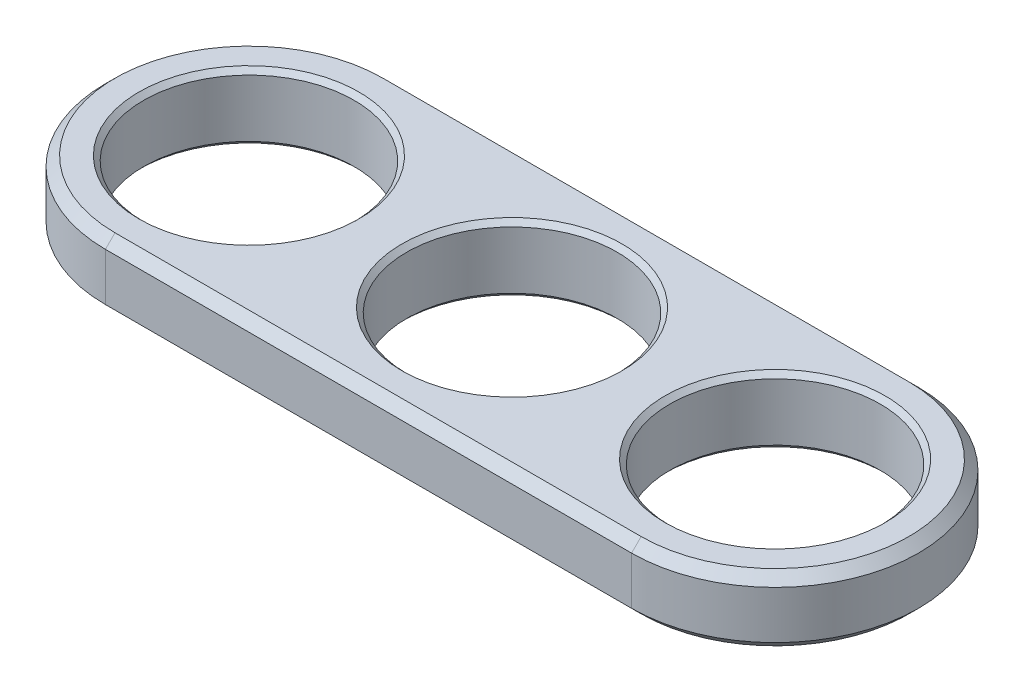
ISO-10303-21;
HEADER;
FILE_DESCRIPTION(('STEP AP214'),'2;1');
FILE_NAME('part.step','',(''),(''),'','','');
FILE_SCHEMA(('AUTOMOTIVE_DESIGN { 1 0 10303 214 1 1 1 1 }'));
ENDSEC;
DATA;
#1=APPLICATION_CONTEXT('core data for automotive mechanical design processes');
#2=APPLICATION_PROTOCOL_DEFINITION('international standard','automotive_design',2000,#1);
#3=PRODUCT_CONTEXT('',#1,'mechanical');
#4=PRODUCT('Part','Part','',(#3));
#5=PRODUCT_RELATED_PRODUCT_CATEGORY('part','',(#4));
#6=PRODUCT_DEFINITION_FORMATION('','',#4);
#7=PRODUCT_DEFINITION_CONTEXT('part definition',#1,'design');
#8=PRODUCT_DEFINITION('design','',#6,#7);
#9=PRODUCT_DEFINITION_SHAPE('','',#8);
#10=(LENGTH_UNIT() NAMED_UNIT(*) SI_UNIT(.MILLI.,.METRE.));
#11=(NAMED_UNIT(*) PLANE_ANGLE_UNIT() SI_UNIT($,.RADIAN.));
#12=(NAMED_UNIT(*) SI_UNIT($,.STERADIAN.) SOLID_ANGLE_UNIT());
#13=UNCERTAINTY_MEASURE_WITH_UNIT(LENGTH_MEASURE(1.E-05),#10,'distance_accuracy_value','');
#14=(GEOMETRIC_REPRESENTATION_CONTEXT(3) GLOBAL_UNCERTAINTY_ASSIGNED_CONTEXT((#13)) GLOBAL_UNIT_ASSIGNED_CONTEXT((#10,
#11,#12)) REPRESENTATION_CONTEXT('',''));
#15=CARTESIAN_POINT('',(0.,0.,0.));
#16=DIRECTION('',(0.,0.,1.));
#17=DIRECTION('',(1.,0.,0.));
#18=AXIS2_PLACEMENT_3D('',#15,#16,#17);
#19=CARTESIAN_POINT('',(0.,7.,0.));
#20=DIRECTION('',(0.,1.,0.));
#21=DIRECTION('',(0.,0.,1.));
#22=AXIS2_PLACEMENT_3D('',#19,#20,#21);
#23=PLANE('',#22);
#24=CARTESIAN_POINT('',(55.,7.,0.));
#25=DIRECTION('',(0.,1.,0.));
#26=DIRECTION('',(0.,0.,1.));
#27=AXIS2_PLACEMENT_3D('',#24,#25,#26);
#28=CIRCLE('',#27,14.);
#29=CARTESIAN_POINT('',(55.,7.,14.));
#30=VERTEX_POINT('',#29);
#31=CARTESIAN_POINT('',(55.,7.,-14.));
#32=VERTEX_POINT('',#31);
#33=EDGE_CURVE('E59',#30,#32,#28,.T.);
#34=ORIENTED_EDGE('',*,*,#33,.T.);
#35=DIRECTION('',(-1.,0.,0.));
#36=VECTOR('',#35,1.);
#37=CARTESIAN_POINT('',(0.,7.,-14.));
#38=LINE('',#37,#36);
#39=CARTESIAN_POINT('',(0.,7.,-14.));
#40=VERTEX_POINT('',#39);
#41=EDGE_CURVE('E11',#32,#40,#38,.T.);
#42=ORIENTED_EDGE('',*,*,#41,.T.);
#43=CARTESIAN_POINT('',(0.,7.,0.));
#44=DIRECTION('',(0.,1.,0.));
#45=DIRECTION('',(0.,0.,1.));
#46=AXIS2_PLACEMENT_3D('',#43,#44,#45);
#47=CIRCLE('',#46,14.);
#48=CARTESIAN_POINT('',(0.,7.,14.));
#49=VERTEX_POINT('',#48);
#50=EDGE_CURVE('E44',#40,#49,#47,.T.);
#51=ORIENTED_EDGE('',*,*,#50,.T.);
#52=DIRECTION('',(1.,0.,0.));
#53=VECTOR('',#52,1.);
#54=CARTESIAN_POINT('',(55.,7.,14.));
#55=LINE('',#54,#53);
#56=EDGE_CURVE('E188',#49,#30,#55,.T.);
#57=ORIENTED_EDGE('',*,*,#56,.T.);
#58=EDGE_LOOP('',(#34,#42,#51,#57));
#59=FACE_BOUND('',#58,.T.);
#60=CARTESIAN_POINT('',(55.,7.,0.));
#61=DIRECTION('',(0.,1.,0.));
#62=DIRECTION('',(0.,0.,1.));
#63=AXIS2_PLACEMENT_3D('',#60,#61,#62);
#64=CIRCLE('',#63,11.5);
#65=CARTESIAN_POINT('',(55.,7.,11.5));
#66=VERTEX_POINT('',#65);
#67=EDGE_CURVE('E227',#66,#66,#64,.F.);
#68=ORIENTED_EDGE('',*,*,#67,.T.);
#69=EDGE_LOOP('',(#68));
#70=FACE_BOUND('',#69,.T.);
#71=CARTESIAN_POINT('',(27.5,7.,0.));
#72=DIRECTION('',(0.,1.,0.));
#73=DIRECTION('',(0.,0.,1.));
#74=AXIS2_PLACEMENT_3D('',#71,#72,#73);
#75=CIRCLE('',#74,11.5);
#76=CARTESIAN_POINT('',(27.5,7.,11.5));
#77=VERTEX_POINT('',#76);
#78=EDGE_CURVE('E224',#77,#77,#75,.F.);
#79=ORIENTED_EDGE('',*,*,#78,.T.);
#80=EDGE_LOOP('',(#79));
#81=FACE_BOUND('',#80,.T.);
#82=CARTESIAN_POINT('',(0.,7.,0.));
#83=DIRECTION('',(0.,1.,0.));
#84=DIRECTION('',(0.,0.,1.));
#85=AXIS2_PLACEMENT_3D('',#82,#83,#84);
#86=CIRCLE('',#85,11.5);
#87=CARTESIAN_POINT('',(0.,7.,11.5));
#88=VERTEX_POINT('',#87);
#89=EDGE_CURVE('E221',#88,#88,#86,.F.);
#90=ORIENTED_EDGE('',*,*,#89,.T.);
#91=EDGE_LOOP('',(#90));
#92=FACE_BOUND('',#91,.T.);
#93=ADVANCED_FACE('F35',(#59,#70,#81,#92),#23,.T.);
#94=CARTESIAN_POINT('',(0.,0.,0.));
#95=DIRECTION('',(0.,1.,0.));
#96=DIRECTION('',(0.,0.,1.));
#97=AXIS2_PLACEMENT_3D('',#94,#95,#96);
#98=PLANE('',#97);
#99=CARTESIAN_POINT('',(0.,0.,0.));
#100=DIRECTION('',(0.,1.,0.));
#101=DIRECTION('',(0.,0.,1.));
#102=AXIS2_PLACEMENT_3D('',#99,#100,#101);
#103=CIRCLE('',#102,14.);
#104=CARTESIAN_POINT('',(0.,0.,14.));
#105=VERTEX_POINT('',#104);
#106=CARTESIAN_POINT('',(0.,0.,-14.));
#107=VERTEX_POINT('',#106);
#108=EDGE_CURVE('E175',#105,#107,#103,.F.);
#109=ORIENTED_EDGE('',*,*,#108,.T.);
#110=DIRECTION('',(1.,0.,0.));
#111=VECTOR('',#110,1.);
#112=CARTESIAN_POINT('',(0.,0.,-14.));
#113=LINE('',#112,#111);
#114=CARTESIAN_POINT('',(55.,0.,-14.));
#115=VERTEX_POINT('',#114);
#116=EDGE_CURVE('E115',#107,#115,#113,.T.);
#117=ORIENTED_EDGE('',*,*,#116,.T.);
#118=CARTESIAN_POINT('',(55.,0.,0.));
#119=DIRECTION('',(0.,1.,0.));
#120=DIRECTION('',(0.,0.,1.));
#121=AXIS2_PLACEMENT_3D('',#118,#119,#120);
#122=CIRCLE('',#121,14.);
#123=CARTESIAN_POINT('',(55.,0.,14.));
#124=VERTEX_POINT('',#123);
#125=EDGE_CURVE('E164',#115,#124,#122,.F.);
#126=ORIENTED_EDGE('',*,*,#125,.T.);
#127=DIRECTION('',(-1.,0.,0.));
#128=VECTOR('',#127,1.);
#129=CARTESIAN_POINT('',(0.,0.,14.));
#130=LINE('',#129,#128);
#131=EDGE_CURVE('E172',#124,#105,#130,.T.);
#132=ORIENTED_EDGE('',*,*,#131,.T.);
#133=EDGE_LOOP('',(#109,#117,#126,#132));
#134=FACE_BOUND('',#133,.T.);
#135=CARTESIAN_POINT('',(55.,0.,0.));
#136=DIRECTION('',(0.,1.,0.));
#137=DIRECTION('',(0.,0.,1.));
#138=AXIS2_PLACEMENT_3D('',#135,#136,#137);
#139=CIRCLE('',#138,11.5);
#140=CARTESIAN_POINT('',(55.,0.,11.5));
#141=VERTEX_POINT('',#140);
#142=EDGE_CURVE('E212',#141,#141,#139,.T.);
#143=ORIENTED_EDGE('',*,*,#142,.T.);
#144=EDGE_LOOP('',(#143));
#145=FACE_BOUND('',#144,.T.);
#146=CARTESIAN_POINT('',(27.5,0.,0.));
#147=DIRECTION('',(0.,1.,0.));
#148=DIRECTION('',(0.,0.,1.));
#149=AXIS2_PLACEMENT_3D('',#146,#147,#148);
#150=CIRCLE('',#149,11.5);
#151=CARTESIAN_POINT('',(27.5,0.,11.5));
#152=VERTEX_POINT('',#151);
#153=EDGE_CURVE('E209',#152,#152,#150,.T.);
#154=ORIENTED_EDGE('',*,*,#153,.T.);
#155=EDGE_LOOP('',(#154));
#156=FACE_BOUND('',#155,.T.);
#157=CARTESIAN_POINT('',(0.,0.,0.));
#158=DIRECTION('',(0.,1.,0.));
#159=DIRECTION('',(0.,0.,1.));
#160=AXIS2_PLACEMENT_3D('',#157,#158,#159);
#161=CIRCLE('',#160,11.5);
#162=CARTESIAN_POINT('',(0.,0.,11.5));
#163=VERTEX_POINT('',#162);
#164=EDGE_CURVE('E203',#163,#163,#161,.T.);
#165=ORIENTED_EDGE('',*,*,#164,.T.);
#166=EDGE_LOOP('',(#165));
#167=FACE_BOUND('',#166,.T.);
#168=ADVANCED_FACE('F253',(#134,#145,#156,#167),#98,.F.);
#169=CARTESIAN_POINT('',(0.,7.,0.));
#170=DIRECTION('',(0.,-1.,0.));
#171=DIRECTION('',(0.,0.,-1.));
#172=AXIS2_PLACEMENT_3D('',#169,#170,#171);
#173=CYLINDRICAL_SURFACE('',#172,15.);
#174=DIRECTION('',(0.,-1.,0.));
#175=VECTOR('',#174,1.);
#176=CARTESIAN_POINT('',(0.,7.,-15.));
#177=LINE('',#176,#175);
#178=CARTESIAN_POINT('',(0.,6.,-15.));
#179=VERTEX_POINT('',#178);
#180=CARTESIAN_POINT('',(0.,0.999999999999987,-15.));
#181=VERTEX_POINT('',#180);
#182=EDGE_CURVE('E108',#179,#181,#177,.T.);
#183=ORIENTED_EDGE('',*,*,#182,.T.);
#184=CARTESIAN_POINT('',(0.,0.999999999999987,0.));
#185=DIRECTION('',(0.,1.,0.));
#186=DIRECTION('',(0.,0.,1.));
#187=AXIS2_PLACEMENT_3D('',#184,#185,#186);
#188=CIRCLE('',#187,15.);
#189=CARTESIAN_POINT('',(0.,0.999999999999987,15.));
#190=VERTEX_POINT('',#189);
#191=EDGE_CURVE('E114',#181,#190,#188,.T.);
#192=ORIENTED_EDGE('',*,*,#191,.T.);
#193=DIRECTION('',(0.,-1.,0.));
#194=VECTOR('',#193,1.);
#195=CARTESIAN_POINT('',(0.,7.,15.));
#196=LINE('',#195,#194);
#197=CARTESIAN_POINT('',(0.,6.,15.));
#198=VERTEX_POINT('',#197);
#199=EDGE_CURVE('E110',#198,#190,#196,.T.);
#200=ORIENTED_EDGE('',*,*,#199,.F.);
#201=CARTESIAN_POINT('',(0.,6.,0.));
#202=DIRECTION('',(0.,1.,0.));
#203=DIRECTION('',(0.,0.,1.));
#204=AXIS2_PLACEMENT_3D('',#201,#202,#203);
#205=CIRCLE('',#204,15.);
#206=EDGE_CURVE('E105',#198,#179,#205,.F.);
#207=ORIENTED_EDGE('',*,*,#206,.T.);
#208=EDGE_LOOP('',(#183,#192,#200,#207));
#209=FACE_BOUND('',#208,.T.);
#210=ADVANCED_FACE('F107',(#209),#173,.T.);
#211=CARTESIAN_POINT('',(0.,7.,15.));
#212=DIRECTION('',(0.,0.,-1.));
#213=DIRECTION('',(-1.,0.,0.));
#214=AXIS2_PLACEMENT_3D('',#211,#212,#213);
#215=PLANE('',#214);
#216=ORIENTED_EDGE('',*,*,#199,.T.);
#217=DIRECTION('',(1.,0.,0.));
#218=VECTOR('',#217,1.);
#219=CARTESIAN_POINT('',(0.,0.999999999999987,15.));
#220=LINE('',#219,#218);
#221=CARTESIAN_POINT('',(55.,0.999999999999987,15.));
#222=VERTEX_POINT('',#221);
#223=EDGE_CURVE('E171',#190,#222,#220,.T.);
#224=ORIENTED_EDGE('',*,*,#223,.T.);
#225=DIRECTION('',(0.,-1.,0.));
#226=VECTOR('',#225,1.);
#227=CARTESIAN_POINT('',(55.,7.,15.));
#228=LINE('',#227,#226);
#229=CARTESIAN_POINT('',(55.,6.,15.));
#230=VERTEX_POINT('',#229);
#231=EDGE_CURVE('E199',#230,#222,#228,.T.);
#232=ORIENTED_EDGE('',*,*,#231,.F.);
#233=DIRECTION('',(-1.,0.,0.));
#234=VECTOR('',#233,1.);
#235=CARTESIAN_POINT('',(0.,6.,15.));
#236=LINE('',#235,#234);
#237=EDGE_CURVE('E185',#230,#198,#236,.T.);
#238=ORIENTED_EDGE('',*,*,#237,.T.);
#239=EDGE_LOOP('',(#216,#224,#232,#238));
#240=FACE_BOUND('',#239,.T.);
#241=ADVANCED_FACE('F201',(#240),#215,.F.);
#242=CARTESIAN_POINT('',(55.,7.,0.));
#243=DIRECTION('',(0.,-1.,0.));
#244=DIRECTION('',(0.,0.,-1.));
#245=AXIS2_PLACEMENT_3D('',#242,#243,#244);
#246=CYLINDRICAL_SURFACE('',#245,15.);
#247=ORIENTED_EDGE('',*,*,#231,.T.);
#248=CARTESIAN_POINT('',(55.,0.999999999999987,0.));
#249=DIRECTION('',(0.,1.,0.));
#250=DIRECTION('',(0.,0.,1.));
#251=AXIS2_PLACEMENT_3D('',#248,#249,#250);
#252=CIRCLE('',#251,15.);
#253=CARTESIAN_POINT('',(55.,0.999999999999987,-15.));
#254=VERTEX_POINT('',#253);
#255=EDGE_CURVE('E166',#222,#254,#252,.T.);
#256=ORIENTED_EDGE('',*,*,#255,.T.);
#257=DIRECTION('',(0.,-1.,0.));
#258=VECTOR('',#257,1.);
#259=CARTESIAN_POINT('',(55.,7.,-15.));
#260=LINE('',#259,#258);
#261=CARTESIAN_POINT('',(55.,6.,-15.));
#262=VERTEX_POINT('',#261);
#263=EDGE_CURVE('E126',#262,#254,#260,.T.);
#264=ORIENTED_EDGE('',*,*,#263,.F.);
#265=CARTESIAN_POINT('',(55.,6.,0.));
#266=DIRECTION('',(0.,1.,0.));
#267=DIRECTION('',(0.,0.,1.));
#268=AXIS2_PLACEMENT_3D('',#265,#266,#267);
#269=CIRCLE('',#268,15.);
#270=EDGE_CURVE('E182',#262,#230,#269,.F.);
#271=ORIENTED_EDGE('',*,*,#270,.T.);
#272=EDGE_LOOP('',(#247,#256,#264,#271));
#273=FACE_BOUND('',#272,.T.);
#274=ADVANCED_FACE('F198',(#273),#246,.T.);
#275=CARTESIAN_POINT('',(0.,7.,-15.));
#276=DIRECTION('',(0.,0.,1.));
#277=DIRECTION('',(1.,0.,0.));
#278=AXIS2_PLACEMENT_3D('',#275,#276,#277);
#279=PLANE('',#278);
#280=ORIENTED_EDGE('',*,*,#263,.T.);
#281=DIRECTION('',(-1.,0.,0.));
#282=VECTOR('',#281,1.);
#283=CARTESIAN_POINT('',(0.,0.999999999999987,-15.));
#284=LINE('',#283,#282);
#285=EDGE_CURVE('E125',#254,#181,#284,.T.);
#286=ORIENTED_EDGE('',*,*,#285,.T.);
#287=ORIENTED_EDGE('',*,*,#182,.F.);
#288=DIRECTION('',(1.,0.,0.));
#289=VECTOR('',#288,1.);
#290=CARTESIAN_POINT('',(55.,6.,-15.));
#291=LINE('',#290,#289);
#292=EDGE_CURVE('E122',#179,#262,#291,.T.);
#293=ORIENTED_EDGE('',*,*,#292,.T.);
#294=EDGE_LOOP('',(#280,#286,#287,#293));
#295=FACE_BOUND('',#294,.T.);
#296=ADVANCED_FACE('F121',(#295),#279,.F.);
#297=CARTESIAN_POINT('',(27.5,7.,0.));
#298=DIRECTION('',(0.,-1.,0.));
#299=DIRECTION('',(0.,0.,-1.));
#300=AXIS2_PLACEMENT_3D('',#297,#298,#299);
#301=CYLINDRICAL_SURFACE('',#300,11.);
#302=CARTESIAN_POINT('',(27.5,0.499999999999997,0.));
#303=DIRECTION('',(0.,1.,0.));
#304=DIRECTION('',(0.,0.,1.));
#305=AXIS2_PLACEMENT_3D('',#302,#303,#304);
#306=CIRCLE('',#305,11.);
#307=CARTESIAN_POINT('',(27.5,0.499999999999997,11.));
#308=VERTEX_POINT('',#307);
#309=EDGE_CURVE('E233',#308,#308,#306,.F.);
#310=ORIENTED_EDGE('',*,*,#309,.T.);
#311=EDGE_LOOP('',(#310));
#312=FACE_BOUND('',#311,.T.);
#313=CARTESIAN_POINT('',(27.5,6.49999999999998,0.));
#314=DIRECTION('',(0.,1.,0.));
#315=DIRECTION('',(0.,0.,1.));
#316=AXIS2_PLACEMENT_3D('',#313,#314,#315);
#317=CIRCLE('',#316,11.);
#318=CARTESIAN_POINT('',(27.5,6.49999999999998,11.));
#319=VERTEX_POINT('',#318);
#320=EDGE_CURVE('E230',#319,#319,#317,.T.);
#321=ORIENTED_EDGE('',*,*,#320,.T.);
#322=EDGE_LOOP('',(#321));
#323=FACE_BOUND('',#322,.T.);
#324=ADVANCED_FACE('F267',(#312,#323),#301,.F.);
#325=CARTESIAN_POINT('',(0.,7.,0.));
#326=DIRECTION('',(0.,-1.,0.));
#327=DIRECTION('',(0.,0.,-1.));
#328=AXIS2_PLACEMENT_3D('',#325,#326,#327);
#329=CYLINDRICAL_SURFACE('',#328,11.);
#330=CARTESIAN_POINT('',(0.,0.500000000000007,0.));
#331=DIRECTION('',(0.,1.,0.));
#332=DIRECTION('',(0.,0.,1.));
#333=AXIS2_PLACEMENT_3D('',#330,#331,#332);
#334=CIRCLE('',#333,11.);
#335=CARTESIAN_POINT('',(0.,0.500000000000007,11.));
#336=VERTEX_POINT('',#335);
#337=EDGE_CURVE('E132',#336,#336,#334,.F.);
#338=ORIENTED_EDGE('',*,*,#337,.T.);
#339=EDGE_LOOP('',(#338));
#340=FACE_BOUND('',#339,.T.);
#341=CARTESIAN_POINT('',(0.,6.49999999999999,0.));
#342=DIRECTION('',(0.,1.,0.));
#343=DIRECTION('',(0.,0.,1.));
#344=AXIS2_PLACEMENT_3D('',#341,#342,#343);
#345=CIRCLE('',#344,11.);
#346=CARTESIAN_POINT('',(0.,6.49999999999999,11.));
#347=VERTEX_POINT('',#346);
#348=EDGE_CURVE('E236',#347,#347,#345,.T.);
#349=ORIENTED_EDGE('',*,*,#348,.T.);
#350=EDGE_LOOP('',(#349));
#351=FACE_BOUND('',#350,.T.);
#352=ADVANCED_FACE('F242',(#340,#351),#329,.F.);
#353=CARTESIAN_POINT('',(55.,7.,0.));
#354=DIRECTION('',(0.,-1.,0.));
#355=DIRECTION('',(0.,0.,-1.));
#356=AXIS2_PLACEMENT_3D('',#353,#354,#355);
#357=CYLINDRICAL_SURFACE('',#356,11.);
#358=CARTESIAN_POINT('',(55.,0.500000000000007,0.));
#359=DIRECTION('',(0.,1.,0.));
#360=DIRECTION('',(0.,0.,1.));
#361=AXIS2_PLACEMENT_3D('',#358,#359,#360);
#362=CIRCLE('',#361,11.);
#363=CARTESIAN_POINT('',(55.,0.500000000000007,11.));
#364=VERTEX_POINT('',#363);
#365=EDGE_CURVE('E218',#364,#364,#362,.F.);
#366=ORIENTED_EDGE('',*,*,#365,.T.);
#367=EDGE_LOOP('',(#366));
#368=FACE_BOUND('',#367,.T.);
#369=CARTESIAN_POINT('',(55.,6.49999999999999,0.));
#370=DIRECTION('',(0.,1.,0.));
#371=DIRECTION('',(0.,0.,1.));
#372=AXIS2_PLACEMENT_3D('',#369,#370,#371);
#373=CIRCLE('',#372,11.);
#374=CARTESIAN_POINT('',(55.,6.49999999999999,11.));
#375=VERTEX_POINT('',#374);
#376=EDGE_CURVE('E215',#375,#375,#373,.T.);
#377=ORIENTED_EDGE('',*,*,#376,.T.);
#378=EDGE_LOOP('',(#377));
#379=FACE_BOUND('',#378,.T.);
#380=ADVANCED_FACE('F276',(#368,#379),#357,.F.);
#381=CARTESIAN_POINT('',(55.,0.,0.));
#382=DIRECTION('',(0.,-1.,0.));
#383=DIRECTION('',(0.,0.,-1.));
#384=AXIS2_PLACEMENT_3D('',#381,#382,#383);
#385=CONICAL_SURFACE('',#384,11.5,0.785398163397445);
#386=ORIENTED_EDGE('',*,*,#365,.F.);
#387=EDGE_LOOP('',(#386));
#388=FACE_BOUND('',#387,.T.);
#389=ORIENTED_EDGE('',*,*,#142,.F.);
#390=EDGE_LOOP('',(#389));
#391=FACE_BOUND('',#390,.T.);
#392=ADVANCED_FACE('F272',(#388,#391),#385,.F.);
#393=CARTESIAN_POINT('',(55.,6.49999999999999,0.));
#394=DIRECTION('',(0.,1.,0.));
#395=DIRECTION('',(0.,0.,1.));
#396=AXIS2_PLACEMENT_3D('',#393,#394,#395);
#397=CONICAL_SURFACE('',#396,11.,0.785398163397452);
#398=ORIENTED_EDGE('',*,*,#67,.F.);
#399=EDGE_LOOP('',(#398));
#400=FACE_BOUND('',#399,.T.);
#401=ORIENTED_EDGE('',*,*,#376,.F.);
#402=EDGE_LOOP('',(#401));
#403=FACE_BOUND('',#402,.T.);
#404=ADVANCED_FACE('F275',(#400,#403),#397,.F.);
#405=CARTESIAN_POINT('',(27.5,0.,0.));
#406=DIRECTION('',(0.,-1.,0.));
#407=DIRECTION('',(0.,0.,-1.));
#408=AXIS2_PLACEMENT_3D('',#405,#406,#407);
#409=CONICAL_SURFACE('',#408,11.5,0.785398163397445);
#410=ORIENTED_EDGE('',*,*,#309,.F.);
#411=EDGE_LOOP('',(#410));
#412=FACE_BOUND('',#411,.T.);
#413=ORIENTED_EDGE('',*,*,#153,.F.);
#414=EDGE_LOOP('',(#413));
#415=FACE_BOUND('',#414,.T.);
#416=ADVANCED_FACE('F280',(#412,#415),#409,.F.);
#417=CARTESIAN_POINT('',(27.5,6.49999999999998,0.));
#418=DIRECTION('',(0.,1.,0.));
#419=DIRECTION('',(0.,0.,1.));
#420=AXIS2_PLACEMENT_3D('',#417,#418,#419);
#421=CONICAL_SURFACE('',#420,11.,0.785398163397452);
#422=ORIENTED_EDGE('',*,*,#78,.F.);
#423=EDGE_LOOP('',(#422));
#424=FACE_BOUND('',#423,.T.);
#425=ORIENTED_EDGE('',*,*,#320,.F.);
#426=EDGE_LOOP('',(#425));
#427=FACE_BOUND('',#426,.T.);
#428=ADVANCED_FACE('F249',(#424,#427),#421,.F.);
#429=CARTESIAN_POINT('',(0.,0.,0.));
#430=DIRECTION('',(0.,-1.,0.));
#431=DIRECTION('',(0.,0.,-1.));
#432=AXIS2_PLACEMENT_3D('',#429,#430,#431);
#433=CONICAL_SURFACE('',#432,11.5,0.785398163397445);
#434=ORIENTED_EDGE('',*,*,#337,.F.);
#435=EDGE_LOOP('',(#434));
#436=FACE_BOUND('',#435,.T.);
#437=ORIENTED_EDGE('',*,*,#164,.F.);
#438=EDGE_LOOP('',(#437));
#439=FACE_BOUND('',#438,.T.);
#440=ADVANCED_FACE('F245',(#436,#439),#433,.F.);
#441=CARTESIAN_POINT('',(0.,6.49999999999999,0.));
#442=DIRECTION('',(0.,1.,0.));
#443=DIRECTION('',(0.,0.,1.));
#444=AXIS2_PLACEMENT_3D('',#441,#442,#443);
#445=CONICAL_SURFACE('',#444,11.,0.785398163397452);
#446=ORIENTED_EDGE('',*,*,#89,.F.);
#447=EDGE_LOOP('',(#446));
#448=FACE_BOUND('',#447,.T.);
#449=ORIENTED_EDGE('',*,*,#348,.F.);
#450=EDGE_LOOP('',(#449));
#451=FACE_BOUND('',#450,.T.);
#452=ADVANCED_FACE('F248',(#448,#451),#445,.F.);
#453=CARTESIAN_POINT('',(0.,0.999999999999987,15.));
#454=DIRECTION('',(0.,0.707106781186552,-0.707106781186543));
#455=DIRECTION('',(1.,0.,0.));
#456=AXIS2_PLACEMENT_3D('',#453,#454,#455);
#457=PLANE('',#456);
#458=DIRECTION('',(0.,0.707106781186543,0.707106781186552));
#459=VECTOR('',#458,1.);
#460=CARTESIAN_POINT('',(0.,0.,14.));
#461=LINE('',#460,#459);
#462=EDGE_CURVE('E150',#105,#190,#461,.T.);
#463=ORIENTED_EDGE('',*,*,#462,.F.);
#464=ORIENTED_EDGE('',*,*,#131,.F.);
#465=DIRECTION('',(0.,-0.707106781186543,-0.707106781186552));
#466=VECTOR('',#465,1.);
#467=CARTESIAN_POINT('',(55.,0.999999999999987,15.));
#468=LINE('',#467,#466);
#469=EDGE_CURVE('E127',#222,#124,#468,.T.);
#470=ORIENTED_EDGE('',*,*,#469,.F.);
#471=ORIENTED_EDGE('',*,*,#223,.F.);
#472=EDGE_LOOP('',(#463,#464,#470,#471));
#473=FACE_BOUND('',#472,.T.);
#474=ADVANCED_FACE('F170',(#473),#457,.F.);
#475=CARTESIAN_POINT('',(55.,0.999999999999987,0.));
#476=DIRECTION('',(0.,1.,0.));
#477=DIRECTION('',(0.,0.,1.));
#478=AXIS2_PLACEMENT_3D('',#475,#476,#477);
#479=CONICAL_SURFACE('',#478,15.,0.785398163397455);
#480=ORIENTED_EDGE('',*,*,#469,.T.);
#481=ORIENTED_EDGE('',*,*,#125,.F.);
#482=DIRECTION('',(0.,-0.707106781186543,0.707106781186552));
#483=VECTOR('',#482,1.);
#484=CARTESIAN_POINT('',(55.,0.999999999999987,-15.));
#485=LINE('',#484,#483);
#486=EDGE_CURVE('E144',#254,#115,#485,.T.);
#487=ORIENTED_EDGE('',*,*,#486,.F.);
#488=ORIENTED_EDGE('',*,*,#255,.F.);
#489=EDGE_LOOP('',(#480,#481,#487,#488));
#490=FACE_BOUND('',#489,.T.);
#491=ADVANCED_FACE('F162',(#490),#479,.T.);
#492=CARTESIAN_POINT('',(0.,0.999999999999987,0.));
#493=DIRECTION('',(0.,1.,0.));
#494=DIRECTION('',(0.,0.,1.));
#495=AXIS2_PLACEMENT_3D('',#492,#493,#494);
#496=CONICAL_SURFACE('',#495,15.,0.785398163397455);
#497=ORIENTED_EDGE('',*,*,#462,.T.);
#498=ORIENTED_EDGE('',*,*,#191,.F.);
#499=DIRECTION('',(0.,0.707106781186543,-0.707106781186552));
#500=VECTOR('',#499,1.);
#501=CARTESIAN_POINT('',(0.,0.,-14.));
#502=LINE('',#501,#500);
#503=EDGE_CURVE('E141',#107,#181,#502,.T.);
#504=ORIENTED_EDGE('',*,*,#503,.F.);
#505=ORIENTED_EDGE('',*,*,#108,.F.);
#506=EDGE_LOOP('',(#497,#498,#504,#505));
#507=FACE_BOUND('',#506,.T.);
#508=ADVANCED_FACE('F294',(#507),#496,.T.);
#509=CARTESIAN_POINT('',(0.,0.999999999999987,-15.));
#510=DIRECTION('',(0.,0.707106781186552,0.707106781186543));
#511=DIRECTION('',(-1.,0.,0.));
#512=AXIS2_PLACEMENT_3D('',#509,#510,#511);
#513=PLANE('',#512);
#514=ORIENTED_EDGE('',*,*,#486,.T.);
#515=ORIENTED_EDGE('',*,*,#116,.F.);
#516=ORIENTED_EDGE('',*,*,#503,.T.);
#517=ORIENTED_EDGE('',*,*,#285,.F.);
#518=EDGE_LOOP('',(#514,#515,#516,#517));
#519=FACE_BOUND('',#518,.T.);
#520=ADVANCED_FACE('F291',(#519),#513,.F.);
#521=CARTESIAN_POINT('',(0.,7.,14.));
#522=DIRECTION('',(0.,0.707106781186543,0.707106781186552));
#523=DIRECTION('',(-1.,0.,0.));
#524=AXIS2_PLACEMENT_3D('',#521,#522,#523);
#525=PLANE('',#524);
#526=DIRECTION('',(0.,0.707106781186552,-0.707106781186543));
#527=VECTOR('',#526,1.);
#528=CARTESIAN_POINT('',(0.,6.,15.));
#529=LINE('',#528,#527);
#530=EDGE_CURVE('E136',#198,#49,#529,.T.);
#531=ORIENTED_EDGE('',*,*,#530,.F.);
#532=ORIENTED_EDGE('',*,*,#237,.F.);
#533=DIRECTION('',(0.,-0.707106781186552,0.707106781186543));
#534=VECTOR('',#533,1.);
#535=CARTESIAN_POINT('',(55.,7.,14.));
#536=LINE('',#535,#534);
#537=EDGE_CURVE('E39',#30,#230,#536,.T.);
#538=ORIENTED_EDGE('',*,*,#537,.F.);
#539=ORIENTED_EDGE('',*,*,#56,.F.);
#540=EDGE_LOOP('',(#531,#532,#538,#539));
#541=FACE_BOUND('',#540,.T.);
#542=ADVANCED_FACE('F37',(#541),#525,.T.);
#543=CARTESIAN_POINT('',(55.,7.,0.));
#544=DIRECTION('',(0.,-1.,0.));
#545=DIRECTION('',(0.,0.,-1.));
#546=AXIS2_PLACEMENT_3D('',#543,#544,#545);
#547=CONICAL_SURFACE('',#546,14.,0.785398163397441);
#548=ORIENTED_EDGE('',*,*,#537,.T.);
#549=ORIENTED_EDGE('',*,*,#270,.F.);
#550=DIRECTION('',(0.,-0.707106781186552,-0.707106781186543));
#551=VECTOR('',#550,1.);
#552=CARTESIAN_POINT('',(55.,7.,-14.));
#553=LINE('',#552,#551);
#554=EDGE_CURVE('E130',#32,#262,#553,.T.);
#555=ORIENTED_EDGE('',*,*,#554,.F.);
#556=ORIENTED_EDGE('',*,*,#33,.F.);
#557=EDGE_LOOP('',(#548,#549,#555,#556));
#558=FACE_BOUND('',#557,.T.);
#559=ADVANCED_FACE('F194',(#558),#547,.T.);
#560=CARTESIAN_POINT('',(0.,7.,0.));
#561=DIRECTION('',(0.,-1.,0.));
#562=DIRECTION('',(0.,0.,-1.));
#563=AXIS2_PLACEMENT_3D('',#560,#561,#562);
#564=CONICAL_SURFACE('',#563,14.,0.785398163397441);
#565=ORIENTED_EDGE('',*,*,#530,.T.);
#566=ORIENTED_EDGE('',*,*,#50,.F.);
#567=DIRECTION('',(0.,0.707106781186552,0.707106781186543));
#568=VECTOR('',#567,1.);
#569=CARTESIAN_POINT('',(0.,6.,-15.));
#570=LINE('',#569,#568);
#571=EDGE_CURVE('E52',#179,#40,#570,.T.);
#572=ORIENTED_EDGE('',*,*,#571,.F.);
#573=ORIENTED_EDGE('',*,*,#206,.F.);
#574=EDGE_LOOP('',(#565,#566,#572,#573));
#575=FACE_BOUND('',#574,.T.);
#576=ADVANCED_FACE('F134',(#575),#564,.T.);
#577=CARTESIAN_POINT('',(0.,7.,-14.));
#578=DIRECTION('',(0.,0.707106781186543,-0.707106781186552));
#579=DIRECTION('',(1.,0.,0.));
#580=AXIS2_PLACEMENT_3D('',#577,#578,#579);
#581=PLANE('',#580);
#582=ORIENTED_EDGE('',*,*,#554,.T.);
#583=ORIENTED_EDGE('',*,*,#292,.F.);
#584=ORIENTED_EDGE('',*,*,#571,.T.);
#585=ORIENTED_EDGE('',*,*,#41,.F.);
#586=EDGE_LOOP('',(#582,#583,#584,#585));
#587=FACE_BOUND('',#586,.T.);
#588=ADVANCED_FACE('F129',(#587),#581,.T.);
#589=CLOSED_SHELL('',(#93,#168,#210,#241,#274,#296,#324,#352,#380,#392,#404,#416,#428,#440,#452,
#474,#491,#508,#520,#542,#559,#576,#588));
#590=MANIFOLD_SOLID_BREP('B2',#589);
#591=ADVANCED_BREP_SHAPE_REPRESENTATION('',(#18,#590),#14);
#592=SHAPE_DEFINITION_REPRESENTATION(#9,#591);
ENDSEC;
END-ISO-10303-21;
